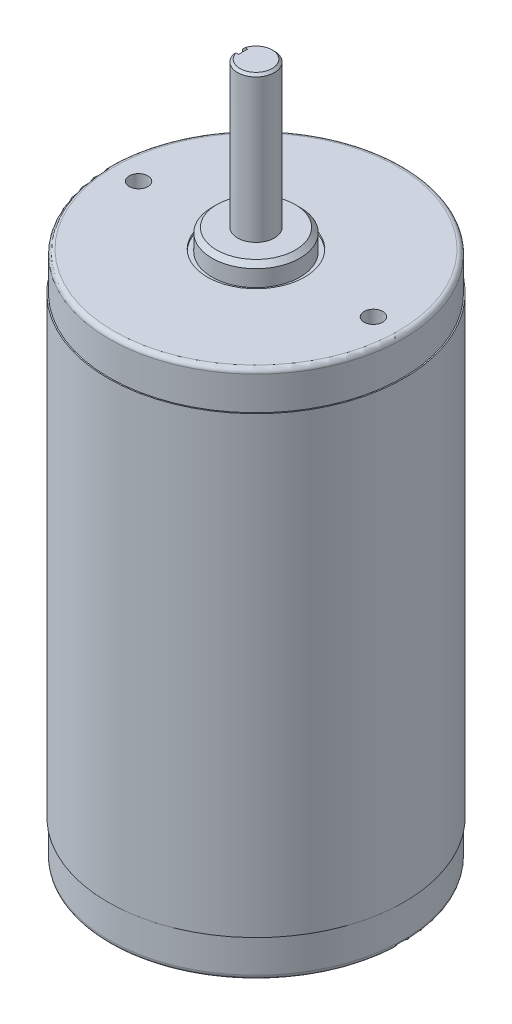
ISO-10303-21;
HEADER;
FILE_DESCRIPTION(('STEP AP214'),'2;1');
FILE_NAME('part.step','',(''),(''),'','','');
FILE_SCHEMA(('AUTOMOTIVE_DESIGN { 1 0 10303 214 1 1 1 1 }'));
ENDSEC;
DATA;
#1=APPLICATION_CONTEXT('core data for automotive mechanical design processes');
#2=APPLICATION_PROTOCOL_DEFINITION('international standard','automotive_design',2000,#1);
#3=PRODUCT_CONTEXT('',#1,'mechanical');
#4=PRODUCT('Part','Part','',(#3));
#5=PRODUCT_RELATED_PRODUCT_CATEGORY('part','',(#4));
#6=PRODUCT_DEFINITION_FORMATION('','',#4);
#7=PRODUCT_DEFINITION_CONTEXT('part definition',#1,'design');
#8=PRODUCT_DEFINITION('design','',#6,#7);
#9=PRODUCT_DEFINITION_SHAPE('','',#8);
#10=(LENGTH_UNIT() NAMED_UNIT(*) SI_UNIT(.MILLI.,.METRE.));
#11=(NAMED_UNIT(*) PLANE_ANGLE_UNIT() SI_UNIT($,.RADIAN.));
#12=(NAMED_UNIT(*) SI_UNIT($,.STERADIAN.) SOLID_ANGLE_UNIT());
#13=UNCERTAINTY_MEASURE_WITH_UNIT(LENGTH_MEASURE(1.E-05),#10,'distance_accuracy_value','');
#14=(GEOMETRIC_REPRESENTATION_CONTEXT(3) GLOBAL_UNCERTAINTY_ASSIGNED_CONTEXT((#13)) GLOBAL_UNIT_ASSIGNED_CONTEXT((#10,
#11,#12)) REPRESENTATION_CONTEXT('',''));
#15=CARTESIAN_POINT('',(0.,0.,0.));
#16=DIRECTION('',(0.,0.,1.));
#17=DIRECTION('',(1.,0.,0.));
#18=AXIS2_PLACEMENT_3D('',#15,#16,#17);
#19=CARTESIAN_POINT('',(15.0368,4.76250000000002,0.));
#20=DIRECTION('',(0.,-1.,0.));
#21=DIRECTION('',(0.,0.,-1.));
#22=AXIS2_PLACEMENT_3D('',#19,#20,#21);
#23=PLANE('',#22);
#24=CARTESIAN_POINT('',(-18.6070906828555,4.76250000000002,11.207359639096));
#25=DIRECTION('',(0.,-1.,0.));
#26=DIRECTION('',(0.,0.,-1.));
#27=AXIS2_PLACEMENT_3D('',#24,#25,#26);
#28=CIRCLE('',#27,4.318);
#29=CARTESIAN_POINT('',(-18.6070906828555,4.76250000000002,6.889359639096));
#30=VERTEX_POINT('',#29);
#31=EDGE_CURVE('E117',#30,#30,#28,.T.);
#32=ORIENTED_EDGE('',*,*,#31,.F.);
#33=EDGE_LOOP('',(#32));
#34=FACE_BOUND('',#33,.T.);
#35=CARTESIAN_POINT('',(0.,4.76250000000002,0.));
#36=DIRECTION('',(0.,-1.,0.));
#37=DIRECTION('',(0.,0.,-1.));
#38=AXIS2_PLACEMENT_3D('',#35,#36,#37);
#39=CIRCLE('',#38,30.7499999999996);
#40=CARTESIAN_POINT('',(0.,4.76250000000002,-30.7499999999996));
#41=VERTEX_POINT('',#40);
#42=EDGE_CURVE('E177',#41,#41,#39,.T.);
#43=ORIENTED_EDGE('',*,*,#42,.T.);
#44=EDGE_LOOP('',(#43));
#45=FACE_BOUND('',#44,.T.);
#46=CARTESIAN_POINT('',(0.,4.76250000000005,0.));
#47=DIRECTION('',(0.,-1.,0.));
#48=DIRECTION('',(0.,0.,-1.));
#49=AXIS2_PLACEMENT_3D('',#46,#47,#48);
#50=CIRCLE('',#49,15.0368);
#51=CARTESIAN_POINT('',(0.,4.76250000000005,-15.0368));
#52=VERTEX_POINT('',#51);
#53=EDGE_CURVE('E162',#52,#52,#50,.T.);
#54=ORIENTED_EDGE('',*,*,#53,.F.);
#55=EDGE_LOOP('',(#54));
#56=FACE_BOUND('',#55,.T.);
#57=CARTESIAN_POINT('',(-11.2073649648726,4.76250000000002,18.6070874750508));
#58=DIRECTION('',(0.,-1.,0.));
#59=DIRECTION('',(-0.467582362918068,0.,-0.883949508675668));
#60=AXIS2_PLACEMENT_3D('',#57,#58,#59);
#61=CIRCLE('',#60,4.318);
#62=CARTESIAN_POINT('',(-13.2263856079528,4.76250000000002,14.7901934965892));
#63=VERTEX_POINT('',#62);
#64=EDGE_CURVE('E335',#63,#63,#61,.T.);
#65=ORIENTED_EDGE('',*,*,#64,.F.);
#66=EDGE_LOOP('',(#65));
#67=FACE_BOUND('',#66,.T.);
#68=ADVANCED_FACE('F38',(#34,#45,#56,#67),#23,.T.);
#69=CARTESIAN_POINT('',(0.,0.,0.));
#70=DIRECTION('',(0.,-1.,0.));
#71=DIRECTION('',(0.,0.,-1.));
#72=AXIS2_PLACEMENT_3D('',#69,#70,#71);
#73=PLANE('',#72);
#74=CARTESIAN_POINT('',(0.,0.,0.));
#75=DIRECTION('',(0.,-1.,0.));
#76=DIRECTION('',(0.,0.,-1.));
#77=AXIS2_PLACEMENT_3D('',#74,#75,#76);
#78=CIRCLE('',#77,14.0368);
#79=CARTESIAN_POINT('',(0.,0.,-14.0368));
#80=VERTEX_POINT('',#79);
#81=EDGE_CURVE('E183',#80,#80,#78,.T.);
#82=ORIENTED_EDGE('',*,*,#81,.T.);
#83=EDGE_LOOP('',(#82));
#84=FACE_BOUND('',#83,.T.);
#85=ADVANCED_FACE('F296',(#84),#73,.T.);
#86=CARTESIAN_POINT('',(0.,0.,0.));
#87=DIRECTION('',(0.,-1.,0.));
#88=DIRECTION('',(0.,0.,-1.));
#89=AXIS2_PLACEMENT_3D('',#86,#87,#88);
#90=CYLINDRICAL_SURFACE('',#89,15.0368);
#91=CARTESIAN_POINT('',(0.,1.,0.));
#92=DIRECTION('',(0.,-1.,0.));
#93=DIRECTION('',(0.,0.,-1.));
#94=AXIS2_PLACEMENT_3D('',#91,#92,#93);
#95=CIRCLE('',#94,15.0368);
#96=CARTESIAN_POINT('',(0.,1.,-15.0368));
#97=VERTEX_POINT('',#96);
#98=EDGE_CURVE('E100',#97,#97,#95,.F.);
#99=ORIENTED_EDGE('',*,*,#98,.T.);
#100=EDGE_LOOP('',(#99));
#101=FACE_BOUND('',#100,.T.);
#102=ORIENTED_EDGE('',*,*,#53,.T.);
#103=EDGE_LOOP('',(#102));
#104=FACE_BOUND('',#103,.T.);
#105=ADVANCED_FACE('F292',(#101,#104),#90,.T.);
#106=CARTESIAN_POINT('',(0.,0.,0.));
#107=DIRECTION('',(0.,-1.,0.));
#108=DIRECTION('',(0.,0.,-1.));
#109=AXIS2_PLACEMENT_3D('',#106,#107,#108);
#110=CYLINDRICAL_SURFACE('',#109,31.7499999999996);
#111=CARTESIAN_POINT('',(0.,5.76250000000002,0.));
#112=DIRECTION('',(0.,-1.,0.));
#113=DIRECTION('',(0.,0.,-1.));
#114=AXIS2_PLACEMENT_3D('',#111,#112,#113);
#115=CIRCLE('',#114,31.7499999999996);
#116=CARTESIAN_POINT('',(0.,5.76250000000002,-31.7499999999996));
#117=VERTEX_POINT('',#116);
#118=EDGE_CURVE('E180',#117,#117,#115,.F.);
#119=ORIENTED_EDGE('',*,*,#118,.T.);
#120=EDGE_LOOP('',(#119));
#121=FACE_BOUND('',#120,.T.);
#122=CARTESIAN_POINT('',(0.,12.9921000000001,0.));
#123=DIRECTION('',(0.,-1.,0.));
#124=DIRECTION('',(0.,0.,-1.));
#125=AXIS2_PLACEMENT_3D('',#122,#123,#124);
#126=CIRCLE('',#125,31.7499999999996);
#127=CARTESIAN_POINT('',(0.,12.9921000000001,-31.7499999999996));
#128=VERTEX_POINT('',#127);
#129=EDGE_CURVE('E159',#128,#128,#126,.T.);
#130=ORIENTED_EDGE('',*,*,#129,.T.);
#131=EDGE_LOOP('',(#130));
#132=FACE_BOUND('',#131,.T.);
#133=ADVANCED_FACE('F288',(#121,#132),#110,.T.);
#134=CARTESIAN_POINT('',(31.7499999999996,12.9921000000001,0.));
#135=DIRECTION('',(0.,-1.,0.));
#136=DIRECTION('',(0.,0.,-1.));
#137=AXIS2_PLACEMENT_3D('',#134,#135,#136);
#138=PLANE('',#137);
#139=CARTESIAN_POINT('',(0.,12.9921000000001,0.));
#140=DIRECTION('',(0.,-1.,0.));
#141=DIRECTION('',(0.,0.,-1.));
#142=AXIS2_PLACEMENT_3D('',#139,#140,#141);
#143=CIRCLE('',#142,32.004);
#144=CARTESIAN_POINT('',(0.,12.9921000000001,-32.004));
#145=VERTEX_POINT('',#144);
#146=EDGE_CURVE('E156',#145,#145,#143,.T.);
#147=ORIENTED_EDGE('',*,*,#146,.T.);
#148=EDGE_LOOP('',(#147));
#149=FACE_BOUND('',#148,.T.);
#150=ORIENTED_EDGE('',*,*,#129,.F.);
#151=EDGE_LOOP('',(#150));
#152=FACE_BOUND('',#151,.T.);
#153=ADVANCED_FACE('F284',(#149,#152),#138,.T.);
#154=CARTESIAN_POINT('',(0.,0.,0.));
#155=DIRECTION('',(0.,-1.,0.));
#156=DIRECTION('',(0.,0.,-1.));
#157=AXIS2_PLACEMENT_3D('',#154,#155,#156);
#158=CYLINDRICAL_SURFACE('',#157,32.0039999999998);
#159=CARTESIAN_POINT('',(0.,111.1377,0.));
#160=DIRECTION('',(0.,-1.,0.));
#161=DIRECTION('',(0.,0.,-1.));
#162=AXIS2_PLACEMENT_3D('',#159,#160,#161);
#163=CIRCLE('',#162,32.0039999999996);
#164=CARTESIAN_POINT('',(0.,111.1377,-32.0039999999996));
#165=VERTEX_POINT('',#164);
#166=EDGE_CURVE('E153',#165,#165,#163,.T.);
#167=ORIENTED_EDGE('',*,*,#166,.T.);
#168=EDGE_LOOP('',(#167));
#169=FACE_BOUND('',#168,.T.);
#170=ORIENTED_EDGE('',*,*,#146,.F.);
#171=EDGE_LOOP('',(#170));
#172=FACE_BOUND('',#171,.T.);
#173=ADVANCED_FACE('F280',(#169,#172),#158,.T.);
#174=CARTESIAN_POINT('',(32.0039999999996,111.1377,0.));
#175=DIRECTION('',(0.,1.,0.));
#176=DIRECTION('',(0.,0.,1.));
#177=AXIS2_PLACEMENT_3D('',#174,#175,#176);
#178=PLANE('',#177);
#179=CARTESIAN_POINT('',(0.,111.1377,0.));
#180=DIRECTION('',(0.,-1.,0.));
#181=DIRECTION('',(0.,0.,-1.));
#182=AXIS2_PLACEMENT_3D('',#179,#180,#181);
#183=CIRCLE('',#182,31.7499999999996);
#184=CARTESIAN_POINT('',(0.,111.1377,-31.7499999999996));
#185=VERTEX_POINT('',#184);
#186=EDGE_CURVE('E150',#185,#185,#183,.T.);
#187=ORIENTED_EDGE('',*,*,#186,.T.);
#188=EDGE_LOOP('',(#187));
#189=FACE_BOUND('',#188,.T.);
#190=ORIENTED_EDGE('',*,*,#166,.F.);
#191=EDGE_LOOP('',(#190));
#192=FACE_BOUND('',#191,.T.);
#193=ADVANCED_FACE('F276',(#189,#192),#178,.T.);
#194=CARTESIAN_POINT('',(0.,0.,0.));
#195=DIRECTION('',(0.,-1.,0.));
#196=DIRECTION('',(0.,0.,-1.));
#197=AXIS2_PLACEMENT_3D('',#194,#195,#196);
#198=CYLINDRICAL_SURFACE('',#197,31.7499999999996);
#199=CARTESIAN_POINT('',(0.,118.3673,0.));
#200=DIRECTION('',(0.,1.,0.));
#201=DIRECTION('',(0.,0.,1.));
#202=AXIS2_PLACEMENT_3D('',#199,#200,#201);
#203=CIRCLE('',#202,31.7499999999996);
#204=CARTESIAN_POINT('',(0.,118.3673,31.7499999999996));
#205=VERTEX_POINT('',#204);
#206=EDGE_CURVE('E171',#205,#205,#203,.F.);
#207=ORIENTED_EDGE('',*,*,#206,.T.);
#208=EDGE_LOOP('',(#207));
#209=FACE_BOUND('',#208,.T.);
#210=ORIENTED_EDGE('',*,*,#186,.F.);
#211=EDGE_LOOP('',(#210));
#212=FACE_BOUND('',#211,.T.);
#213=ADVANCED_FACE('F272',(#209,#212),#198,.T.);
#214=CARTESIAN_POINT('',(31.7499999999996,119.3673,0.));
#215=DIRECTION('',(0.,1.,0.));
#216=DIRECTION('',(0.,0.,1.));
#217=AXIS2_PLACEMENT_3D('',#214,#215,#216);
#218=PLANE('',#217);
#219=CARTESIAN_POINT('',(-25.4,119.3673,0.));
#220=DIRECTION('',(0.,1.,0.));
#221=DIRECTION('',(0.,0.,1.));
#222=AXIS2_PLACEMENT_3D('',#219,#220,#221);
#223=CIRCLE('',#222,2.0193);
#224=CARTESIAN_POINT('',(-25.4,119.3673,2.0193));
#225=VERTEX_POINT('',#224);
#226=EDGE_CURVE('E126',#225,#225,#223,.T.);
#227=ORIENTED_EDGE('',*,*,#226,.F.);
#228=EDGE_LOOP('',(#227));
#229=FACE_BOUND('',#228,.T.);
#230=CARTESIAN_POINT('',(25.4,119.3673,0.));
#231=DIRECTION('',(0.,1.,0.));
#232=DIRECTION('',(0.,0.,1.));
#233=AXIS2_PLACEMENT_3D('',#230,#231,#232);
#234=CIRCLE('',#233,2.0193);
#235=CARTESIAN_POINT('',(25.4,119.3673,2.01929999999999));
#236=VERTEX_POINT('',#235);
#237=EDGE_CURVE('E132',#236,#236,#234,.T.);
#238=ORIENTED_EDGE('',*,*,#237,.F.);
#239=EDGE_LOOP('',(#238));
#240=FACE_BOUND('',#239,.T.);
#241=CARTESIAN_POINT('',(0.,119.3673,0.));
#242=DIRECTION('',(0.,1.,0.));
#243=DIRECTION('',(0.,0.,1.));
#244=AXIS2_PLACEMENT_3D('',#241,#242,#243);
#245=CIRCLE('',#244,30.7499999999996);
#246=CARTESIAN_POINT('',(0.,119.3673,30.7499999999996));
#247=VERTEX_POINT('',#246);
#248=EDGE_CURVE('E174',#247,#247,#245,.T.);
#249=ORIENTED_EDGE('',*,*,#248,.T.);
#250=EDGE_LOOP('',(#249));
#251=FACE_BOUND('',#250,.T.);
#252=CARTESIAN_POINT('',(0.,119.3673,0.));
#253=DIRECTION('',(0.,-1.,0.));
#254=DIRECTION('',(0.,0.,-1.));
#255=AXIS2_PLACEMENT_3D('',#252,#253,#254);
#256=CIRCLE('',#255,10.5282999999996);
#257=CARTESIAN_POINT('',(0.,119.3673,-10.5282999999996));
#258=VERTEX_POINT('',#257);
#259=EDGE_CURVE('E147',#258,#258,#256,.T.);
#260=ORIENTED_EDGE('',*,*,#259,.T.);
#261=EDGE_LOOP('',(#260));
#262=FACE_BOUND('',#261,.T.);
#263=ADVANCED_FACE('F268',(#229,#240,#251,#262),#218,.T.);
#264=CARTESIAN_POINT('',(0.,0.,0.));
#265=DIRECTION('',(0.,-1.,0.));
#266=DIRECTION('',(0.,0.,-1.));
#267=AXIS2_PLACEMENT_3D('',#264,#265,#266);
#268=CYLINDRICAL_SURFACE('',#267,10.5282999999996);
#269=CARTESIAN_POINT('',(0.,118.8593,0.));
#270=DIRECTION('',(0.,-1.,0.));
#271=DIRECTION('',(0.,0.,-1.));
#272=AXIS2_PLACEMENT_3D('',#269,#270,#271);
#273=CIRCLE('',#272,10.5282999999996);
#274=CARTESIAN_POINT('',(0.,118.8593,-10.5282999999996));
#275=VERTEX_POINT('',#274);
#276=EDGE_CURVE('E144',#275,#275,#273,.T.);
#277=ORIENTED_EDGE('',*,*,#276,.T.);
#278=EDGE_LOOP('',(#277));
#279=FACE_BOUND('',#278,.T.);
#280=ORIENTED_EDGE('',*,*,#259,.F.);
#281=EDGE_LOOP('',(#280));
#282=FACE_BOUND('',#281,.T.);
#283=ADVANCED_FACE('F264',(#279,#282),#268,.F.);
#284=CARTESIAN_POINT('',(10.5282999999996,118.8593,0.));
#285=DIRECTION('',(0.,1.,0.));
#286=DIRECTION('',(0.,0.,1.));
#287=AXIS2_PLACEMENT_3D('',#284,#285,#286);
#288=PLANE('',#287);
#289=CARTESIAN_POINT('',(0.,118.8593,0.));
#290=DIRECTION('',(0.,-1.,0.));
#291=DIRECTION('',(0.,0.,-1.));
#292=AXIS2_PLACEMENT_3D('',#289,#290,#291);
#293=CIRCLE('',#292,9.52499999999959);
#294=CARTESIAN_POINT('',(0.,118.8593,-9.52499999999959));
#295=VERTEX_POINT('',#294);
#296=EDGE_CURVE('E141',#295,#295,#293,.T.);
#297=ORIENTED_EDGE('',*,*,#296,.T.);
#298=EDGE_LOOP('',(#297));
#299=FACE_BOUND('',#298,.T.);
#300=ORIENTED_EDGE('',*,*,#276,.F.);
#301=EDGE_LOOP('',(#300));
#302=FACE_BOUND('',#301,.T.);
#303=ADVANCED_FACE('F260',(#299,#302),#288,.T.);
#304=CARTESIAN_POINT('',(0.,0.,0.));
#305=DIRECTION('',(0.,-1.,0.));
#306=DIRECTION('',(0.,0.,-1.));
#307=AXIS2_PLACEMENT_3D('',#304,#305,#306);
#308=CYLINDRICAL_SURFACE('',#307,9.52499999999959);
#309=CARTESIAN_POINT('',(0.,122.41508364,0.));
#310=DIRECTION('',(0.,1.,0.));
#311=DIRECTION('',(0.,0.,1.));
#312=AXIS2_PLACEMENT_3D('',#309,#310,#311);
#313=CIRCLE('',#312,9.52499999999959);
#314=CARTESIAN_POINT('',(0.,122.41508364,9.52499999999959));
#315=VERTEX_POINT('',#314);
#316=EDGE_CURVE('E165',#315,#315,#313,.F.);
#317=ORIENTED_EDGE('',*,*,#316,.T.);
#318=EDGE_LOOP('',(#317));
#319=FACE_BOUND('',#318,.T.);
#320=ORIENTED_EDGE('',*,*,#296,.F.);
#321=EDGE_LOOP('',(#320));
#322=FACE_BOUND('',#321,.T.);
#323=ADVANCED_FACE('F256',(#319,#322),#308,.T.);
#324=CARTESIAN_POINT('',(9.52499999999959,123.4313,0.));
#325=DIRECTION('',(0.,1.,0.));
#326=DIRECTION('',(0.,0.,1.));
#327=AXIS2_PLACEMENT_3D('',#324,#325,#326);
#328=PLANE('',#327);
#329=CARTESIAN_POINT('',(0.,123.4313,0.));
#330=DIRECTION('',(0.,1.,0.));
#331=DIRECTION('',(0.,0.,1.));
#332=AXIS2_PLACEMENT_3D('',#329,#330,#331);
#333=CIRCLE('',#332,8.50878363999956);
#334=CARTESIAN_POINT('',(0.,123.4313,8.50878363999956));
#335=VERTEX_POINT('',#334);
#336=EDGE_CURVE('E168',#335,#335,#333,.T.);
#337=ORIENTED_EDGE('',*,*,#336,.T.);
#338=EDGE_LOOP('',(#337));
#339=FACE_BOUND('',#338,.T.);
#340=CARTESIAN_POINT('',(0.,123.4313,0.));
#341=DIRECTION('',(0.,-1.,0.));
#342=DIRECTION('',(0.,0.,-1.));
#343=AXIS2_PLACEMENT_3D('',#340,#341,#342);
#344=CIRCLE('',#343,4.00000469999957);
#345=CARTESIAN_POINT('',(0.,123.4313,-4.00000469999957));
#346=VERTEX_POINT('',#345);
#347=EDGE_CURVE('E138',#346,#346,#344,.T.);
#348=ORIENTED_EDGE('',*,*,#347,.T.);
#349=EDGE_LOOP('',(#348));
#350=FACE_BOUND('',#349,.T.);
#351=ADVANCED_FACE('F251',(#339,#350),#328,.T.);
#352=CARTESIAN_POINT('',(0.,0.,0.));
#353=DIRECTION('',(0.,-1.,0.));
#354=DIRECTION('',(0.,0.,-1.));
#355=AXIS2_PLACEMENT_3D('',#352,#353,#354);
#356=CYLINDRICAL_SURFACE('',#355,4.00000469999952);
#357=DIRECTION('',(0.,-1.,0.));
#358=VECTOR('',#357,1.);
#359=CARTESIAN_POINT('',(-3.87298871674244,0.,-0.999998));
#360=LINE('',#359,#358);
#361=CARTESIAN_POINT('',(-3.87298871674244,154.423364,-0.999998));
#362=VERTEX_POINT('',#361);
#363=CARTESIAN_POINT('',(-3.87298871674244,125.131364,-0.999998));
#364=VERTEX_POINT('',#363);
#365=EDGE_CURVE('E124',#362,#364,#360,.T.);
#366=ORIENTED_EDGE('',*,*,#365,.F.);
#367=CARTESIAN_POINT('',(0.,154.423364,0.));
#368=DIRECTION('',(0.,1.,0.));
#369=DIRECTION('',(0.,0.,1.));
#370=AXIS2_PLACEMENT_3D('',#367,#368,#369);
#371=CIRCLE('',#370,4.00000469999952);
#372=CARTESIAN_POINT('',(-3.87298871674244,154.423364,0.999998));
#373=VERTEX_POINT('',#372);
#374=EDGE_CURVE('E234',#362,#373,#371,.F.);
#375=ORIENTED_EDGE('',*,*,#374,.T.);
#376=DIRECTION('',(0.,-1.,0.));
#377=VECTOR('',#376,1.);
#378=CARTESIAN_POINT('',(-3.87298871674244,0.,0.999998));
#379=LINE('',#378,#377);
#380=CARTESIAN_POINT('',(-3.87298871674244,125.131364,0.999998));
#381=VERTEX_POINT('',#380);
#382=EDGE_CURVE('E121',#381,#373,#379,.F.);
#383=ORIENTED_EDGE('',*,*,#382,.F.);
#384=CARTESIAN_POINT('',(0.,125.131364,0.));
#385=DIRECTION('',(0.,-1.,0.));
#386=DIRECTION('',(0.,0.,-1.));
#387=AXIS2_PLACEMENT_3D('',#384,#385,#386);
#388=CIRCLE('',#387,4.00000469999952);
#389=EDGE_CURVE('E99',#364,#381,#388,.F.);
#390=ORIENTED_EDGE('',*,*,#389,.F.);
#391=EDGE_LOOP('',(#366,#375,#383,#390));
#392=FACE_BOUND('',#391,.T.);
#393=ORIENTED_EDGE('',*,*,#347,.F.);
#394=EDGE_LOOP('',(#393));
#395=FACE_BOUND('',#394,.T.);
#396=ADVANCED_FACE('F246',(#392,#395),#356,.T.);
#397=CARTESIAN_POINT('',(4.00000469999946,154.931364,0.));
#398=DIRECTION('',(0.,1.,0.));
#399=DIRECTION('',(0.,0.,1.));
#400=AXIS2_PLACEMENT_3D('',#397,#398,#399);
#401=PLANE('',#400);
#402=DIRECTION('',(1.,0.,0.));
#403=VECTOR('',#402,1.);
#404=CARTESIAN_POINT('',(4.00000469999946,154.931364,0.999998));
#405=LINE('',#404,#403);
#406=CARTESIAN_POINT('',(-3.34575863218109,154.931364,0.999998));
#407=VERTEX_POINT('',#406);
#408=CARTESIAN_POINT('',(-2.79985469999946,154.931364,0.999998));
#409=VERTEX_POINT('',#408);
#410=EDGE_CURVE('E93',#407,#409,#405,.T.);
#411=ORIENTED_EDGE('',*,*,#410,.F.);
#412=CARTESIAN_POINT('',(0.,154.931364,0.));
#413=DIRECTION('',(0.,1.,0.));
#414=DIRECTION('',(0.,0.,1.));
#415=AXIS2_PLACEMENT_3D('',#412,#413,#414);
#416=CIRCLE('',#415,3.49200469999945);
#417=CARTESIAN_POINT('',(-3.34575863218109,154.931364,-0.999998));
#418=VERTEX_POINT('',#417);
#419=EDGE_CURVE('E51',#407,#418,#416,.T.);
#420=ORIENTED_EDGE('',*,*,#419,.T.);
#421=DIRECTION('',(-1.,0.,0.));
#422=VECTOR('',#421,1.);
#423=CARTESIAN_POINT('',(-4.00000469999946,154.931364,-0.999998));
#424=LINE('',#423,#422);
#425=CARTESIAN_POINT('',(-2.79985469999946,154.931364,-0.999998));
#426=VERTEX_POINT('',#425);
#427=EDGE_CURVE('E110',#426,#418,#424,.T.);
#428=ORIENTED_EDGE('',*,*,#427,.F.);
#429=DIRECTION('',(0.,0.,-1.));
#430=VECTOR('',#429,1.);
#431=CARTESIAN_POINT('',(-2.79985469999946,154.931364,0.999998));
#432=LINE('',#431,#430);
#433=EDGE_CURVE('E106',#409,#426,#432,.T.);
#434=ORIENTED_EDGE('',*,*,#433,.F.);
#435=EDGE_LOOP('',(#411,#420,#428,#434));
#436=FACE_BOUND('',#435,.T.);
#437=ADVANCED_FACE('F112',(#436),#401,.T.);
#438=CARTESIAN_POINT('',(0.,122.41508364,0.));
#439=DIRECTION('',(0.,-1.,0.));
#440=DIRECTION('',(0.,0.,-1.));
#441=AXIS2_PLACEMENT_3D('',#438,#439,#440);
#442=CONICAL_SURFACE('',#441,9.52499999999959,0.785398163397455);
#443=ORIENTED_EDGE('',*,*,#336,.F.);
#444=EDGE_LOOP('',(#443));
#445=FACE_BOUND('',#444,.T.);
#446=ORIENTED_EDGE('',*,*,#316,.F.);
#447=EDGE_LOOP('',(#446));
#448=FACE_BOUND('',#447,.T.);
#449=ADVANCED_FACE('F304',(#445,#448),#442,.T.);
#450=CARTESIAN_POINT('',(0.,118.3673,0.));
#451=DIRECTION('',(0.,1.,0.));
#452=DIRECTION('',(0.,0.,1.));
#453=AXIS2_PLACEMENT_3D('',#450,#451,#452);
#454=TOROIDAL_SURFACE('',#453,30.7499999999996,1.);
#455=ORIENTED_EDGE('',*,*,#248,.F.);
#456=EDGE_LOOP('',(#455));
#457=FACE_BOUND('',#456,.T.);
#458=ORIENTED_EDGE('',*,*,#206,.F.);
#459=EDGE_LOOP('',(#458));
#460=FACE_BOUND('',#459,.T.);
#461=ADVANCED_FACE('F307',(#457,#460),#454,.T.);
#462=CARTESIAN_POINT('',(0.,5.76250000000002,0.));
#463=DIRECTION('',(0.,-1.,0.));
#464=DIRECTION('',(0.,0.,-1.));
#465=AXIS2_PLACEMENT_3D('',#462,#463,#464);
#466=TOROIDAL_SURFACE('',#465,30.7499999999996,1.);
#467=ORIENTED_EDGE('',*,*,#118,.F.);
#468=EDGE_LOOP('',(#467));
#469=FACE_BOUND('',#468,.T.);
#470=ORIENTED_EDGE('',*,*,#42,.F.);
#471=EDGE_LOOP('',(#470));
#472=FACE_BOUND('',#471,.T.);
#473=ADVANCED_FACE('F311',(#469,#472),#466,.T.);
#474=CARTESIAN_POINT('',(0.,1.,0.));
#475=DIRECTION('',(0.,-1.,0.));
#476=DIRECTION('',(0.,0.,-1.));
#477=AXIS2_PLACEMENT_3D('',#474,#475,#476);
#478=TOROIDAL_SURFACE('',#477,14.0368,1.);
#479=ORIENTED_EDGE('',*,*,#98,.F.);
#480=EDGE_LOOP('',(#479));
#481=FACE_BOUND('',#480,.T.);
#482=ORIENTED_EDGE('',*,*,#81,.F.);
#483=EDGE_LOOP('',(#482));
#484=FACE_BOUND('',#483,.T.);
#485=ADVANCED_FACE('F315',(#481,#484),#478,.T.);
#486=CARTESIAN_POINT('',(25.4,105.7529,0.));
#487=DIRECTION('',(0.,1.,0.));
#488=DIRECTION('',(0.,0.,1.));
#489=AXIS2_PLACEMENT_3D('',#486,#487,#488);
#490=CONICAL_SURFACE('',#489,2.0193,1.02974425867665);
#491=CARTESIAN_POINT('',(25.4,104.539582151998,0.));
#492=VERTEX_POINT('',#491);
#493=VERTEX_LOOP('',#492);
#494=FACE_BOUND('',#493,.T.);
#495=CARTESIAN_POINT('',(25.4,105.7529,0.));
#496=DIRECTION('',(0.,1.,0.));
#497=DIRECTION('',(0.,0.,1.));
#498=AXIS2_PLACEMENT_3D('',#495,#496,#497);
#499=CIRCLE('',#498,2.0193);
#500=CARTESIAN_POINT('',(25.4,105.7529,2.01929999999999));
#501=VERTEX_POINT('',#500);
#502=EDGE_CURVE('E135',#501,#501,#499,.T.);
#503=ORIENTED_EDGE('',*,*,#502,.T.);
#504=EDGE_LOOP('',(#503));
#505=FACE_BOUND('',#504,.T.);
#506=ADVANCED_FACE('F318',(#494,#505),#490,.F.);
#507=CARTESIAN_POINT('',(25.4,119.3673,0.));
#508=DIRECTION('',(0.,1.,0.));
#509=DIRECTION('',(0.,0.,1.));
#510=AXIS2_PLACEMENT_3D('',#507,#508,#509);
#511=CYLINDRICAL_SURFACE('',#510,2.0193);
#512=ORIENTED_EDGE('',*,*,#502,.F.);
#513=EDGE_LOOP('',(#512));
#514=FACE_BOUND('',#513,.T.);
#515=ORIENTED_EDGE('',*,*,#237,.T.);
#516=EDGE_LOOP('',(#515));
#517=FACE_BOUND('',#516,.T.);
#518=ADVANCED_FACE('F324',(#514,#517),#511,.F.);
#519=CARTESIAN_POINT('',(-25.4,105.7529,0.));
#520=DIRECTION('',(0.,1.,0.));
#521=DIRECTION('',(0.,0.,1.));
#522=AXIS2_PLACEMENT_3D('',#519,#520,#521);
#523=CONICAL_SURFACE('',#522,2.0193,1.02974425867665);
#524=CARTESIAN_POINT('',(-25.4,104.539582151998,0.));
#525=VERTEX_POINT('',#524);
#526=VERTEX_LOOP('',#525);
#527=FACE_BOUND('',#526,.T.);
#528=CARTESIAN_POINT('',(-25.4,105.7529,0.));
#529=DIRECTION('',(0.,1.,0.));
#530=DIRECTION('',(0.,0.,1.));
#531=AXIS2_PLACEMENT_3D('',#528,#529,#530);
#532=CIRCLE('',#531,2.0193);
#533=CARTESIAN_POINT('',(-25.4,105.7529,2.0193));
#534=VERTEX_POINT('',#533);
#535=EDGE_CURVE('E129',#534,#534,#532,.T.);
#536=ORIENTED_EDGE('',*,*,#535,.T.);
#537=EDGE_LOOP('',(#536));
#538=FACE_BOUND('',#537,.T.);
#539=ADVANCED_FACE('F483',(#527,#538),#523,.F.);
#540=CARTESIAN_POINT('',(-25.4,119.3673,0.));
#541=DIRECTION('',(0.,1.,0.));
#542=DIRECTION('',(0.,0.,1.));
#543=AXIS2_PLACEMENT_3D('',#540,#541,#542);
#544=CYLINDRICAL_SURFACE('',#543,2.0193);
#545=ORIENTED_EDGE('',*,*,#535,.F.);
#546=EDGE_LOOP('',(#545));
#547=FACE_BOUND('',#546,.T.);
#548=ORIENTED_EDGE('',*,*,#226,.T.);
#549=EDGE_LOOP('',(#548));
#550=FACE_BOUND('',#549,.T.);
#551=ADVANCED_FACE('F210',(#547,#550),#544,.F.);
#552=CARTESIAN_POINT('',(-4.00000469999946,125.131364,-0.999998));
#553=DIRECTION('',(0.,0.,-1.));
#554=DIRECTION('',(-1.,0.,0.));
#555=AXIS2_PLACEMENT_3D('',#552,#553,#554);
#556=PLANE('',#555);
#557=ORIENTED_EDGE('',*,*,#427,.T.);
#558=CARTESIAN_POINT('',(-3.34575863218109,154.931364,-0.999998));
#559=CARTESIAN_POINT('',(-3.43385160215899,154.846926978976,-0.999998));
#560=CARTESIAN_POINT('',(-3.52183393260334,154.762375130216,-0.999998));
#561=CARTESIAN_POINT('',(-3.69757729407254,154.593041796829,-0.999998));
#562=CARTESIAN_POINT('',(-3.78533832514863,154.508260312257,-0.999998));
#563=CARTESIAN_POINT('',(-3.87298871674244,154.423364,-0.999998));
#564=B_SPLINE_CURVE_WITH_KNOTS('',3,(#558,#559,#560,#561,#562,#563),.UNSPECIFIED.,.F.,.F.,(4,2,
4),(0.,0.366072602626518,0.73214512046506),.UNSPECIFIED.);
#565=EDGE_CURVE('E11',#418,#362,#564,.T.);
#566=ORIENTED_EDGE('',*,*,#565,.T.);
#567=ORIENTED_EDGE('',*,*,#365,.T.);
#568=CARTESIAN_POINT('',(-3.79905669443276,125.131364,1.25188091786075));
#569=CARTESIAN_POINT('',(-2.79985469999946,126.610521480319,3.10078421492022));
#570=CARTESIAN_POINT('',(-2.79985469999946,128.215993174737,5.10757656032127));
#571=CARTESIAN_POINT('',(-3.81215439703632,125.131364,1.21215478678005));
#572=CARTESIAN_POINT('',(-2.79985469999946,126.717603162406,2.99272860297843));
#573=CARTESIAN_POINT('',(-2.79985469999946,128.440997221199,4.92770494646071));
#574=CARTESIAN_POINT('',(-3.82607602601714,125.131364,1.16779524297839));
#575=CARTESIAN_POINT('',(-2.79985469999946,126.817214454074,2.87383132031633));
#576=CARTESIAN_POINT('',(-2.79985469999946,128.651075098356,4.73003305864789));
#577=CARTESIAN_POINT('',(-3.854285281745,125.131364,1.07099923687937));
#578=CARTESIAN_POINT('',(-2.79985469999946,127.000530173814,2.61848732446307));
#579=CARTESIAN_POINT('',(-2.79985469999946,129.038769017272,4.30625756965911));
#580=CARTESIAN_POINT('',(-3.86857145888317,125.131364,1.01859155239082));
#581=CARTESIAN_POINT('',(-2.79985469999946,127.084281808879,2.48209057753652));
#582=CARTESIAN_POINT('',(-2.79985469999946,129.216495973371,4.08025577721848));
#583=CARTESIAN_POINT('',(-3.89801342639202,125.131364,0.899833914438038));
#584=CARTESIAN_POINT('',(-2.79985469999946,127.244719077503,2.17779945463202));
#585=CARTESIAN_POINT('',(-2.79985469999946,129.557922261875,3.57698050909868));
#586=CARTESIAN_POINT('',(-3.91306585264883,125.131364,0.832564530970009));
#587=CARTESIAN_POINT('',(-2.79985469999946,127.319307805925,2.00809777209683));
#588=CARTESIAN_POINT('',(-2.79985469999946,129.717334867958,3.29681130005391));
#589=CARTESIAN_POINT('',(-3.94058062131458,125.131364,0.690717280514064));
#590=CARTESIAN_POINT('',(-2.79985469999946,127.448141160549,1.65555417022524));
#591=CARTESIAN_POINT('',(-2.79985469999946,129.99342305222,2.71584710466487));
#592=CARTESIAN_POINT('',(-3.95303907233913,125.131364,0.616128676625266));
#593=CARTESIAN_POINT('',(-2.79985469999946,127.502336718355,1.47270481731396));
#594=CARTESIAN_POINT('',(-2.79985469999946,130.110034618953,2.41502201736828));
#595=CARTESIAN_POINT('',(-3.97543275952185,125.131364,0.451385773374705));
#596=CARTESIAN_POINT('',(-2.79985469999946,127.596441277175,1.07328329743611));
#597=CARTESIAN_POINT('',(-2.79985469999946,130.312887644152,1.75886937420155));
#598=CARTESIAN_POINT('',(-3.98480717107226,125.131364,0.360484238410521));
#599=CARTESIAN_POINT('',(-2.79985469999946,127.633442881905,0.855522533065359));
#600=CARTESIAN_POINT('',(-2.79985469999946,130.392976039456,1.40163569825842));
#601=CARTESIAN_POINT('',(-3.99724032536405,125.131364,0.175303193271348));
#602=CARTESIAN_POINT('',(-2.79985469999946,127.681949523323,0.414716779359214));
#603=CARTESIAN_POINT('',(-2.79985469999946,130.498020650855,0.679190638961237));
#604=CARTESIAN_POINT('',(-4.00029693419917,125.131364,0.0810225527018574));
#605=CARTESIAN_POINT('',(-2.79985469999946,127.693433055952,0.191726261516055));
#606=CARTESIAN_POINT('',(-2.79985469999946,130.522958239367,0.313976602230934));
#607=CARTESIAN_POINT('',(-3.99963811298894,125.131364,-0.116662006867769));
#608=CARTESIAN_POINT('',(-2.79985469999946,127.690941988436,-0.276054100195673));
#609=CARTESIAN_POINT('',(-2.79985469999946,130.517551937729,-0.452080334926588));
#610=CARTESIAN_POINT('',(-3.99522797189927,125.131364,-0.220052379026115));
#611=CARTESIAN_POINT('',(-2.79985469999946,127.674356881745,-0.520755373475166));
#612=CARTESIAN_POINT('',(-2.79985469999946,130.481537121496,-0.852899059660325));
#613=CARTESIAN_POINT('',(-3.97897451054945,125.131364,-0.422010861386271));
#614=CARTESIAN_POINT('',(-2.79985469999946,127.610276786703,-1.00275226484209));
#615=CARTESIAN_POINT('',(-2.79985469999946,130.342860930299,-1.64312157316645));
#616=CARTESIAN_POINT('',(-3.96712637105358,125.131364,-0.520575800420573));
#617=CARTESIAN_POINT('',(-2.79985469999946,127.56278196205,-1.23997160558483));
#618=CARTESIAN_POINT('',(-2.79985469999946,130.240156344147,-2.03251778970508));
#619=CARTESIAN_POINT('',(-3.93790304235114,125.131364,-0.708513448543741));
#620=CARTESIAN_POINT('',(-2.79985469999946,127.436075986486,-1.69903294420047));
#621=CARTESIAN_POINT('',(-2.79985469999946,129.967513734673,-2.78737691914001));
#622=CARTESIAN_POINT('',(-3.92053146978515,125.131364,-0.797892122095242));
#623=CARTESIAN_POINT('',(-2.79985469999947,127.356919105973,-1.92084177708723));
#624=CARTESIAN_POINT('',(-2.79985469999946,129.797619688053,-3.15285530469029));
#625=CARTESIAN_POINT('',(-3.8925084810203,125.131364,-0.92208328673317));
#626=CARTESIAN_POINT('',(-2.79985469999946,127.214464597677,-2.23484305545127));
#627=CARTESIAN_POINT('',(-2.79985469999946,129.493594295214,-3.67127939847112));
#628=CARTESIAN_POINT('',(-3.88284611793795,125.131364,-0.961813801055341));
#629=CARTESIAN_POINT('',(-2.79985469999946,127.163083705247,-2.3363065813234));
#630=CARTESIAN_POINT('',(-2.79985469999946,129.384133649716,-3.83903223434498));
#631=CARTESIAN_POINT('',(-3.86326550067513,125.131364,-1.03766243098715));
#632=CARTESIAN_POINT('',(-2.79985469999946,127.052502981653,-2.53191426862443));
#633=CARTESIAN_POINT('',(-2.79985469999946,129.149130196933,-4.1628124553753));
#634=CARTESIAN_POINT('',(-3.85334742863699,125.131364,-1.07378303314694));
#635=CARTESIAN_POINT('',(-2.79985469999946,126.993312352991,-2.62606531373243));
#636=CARTESIAN_POINT('',(-2.79985469999946,129.023598597369,-4.31884789293767));
#637=CARTESIAN_POINT('',(-3.8347922099221,125.131364,-1.13815616448415));
#638=CARTESIAN_POINT('',(-2.79985469999946,126.874526399355,-2.79552839594543));
#639=CARTESIAN_POINT('',(-2.79985469999946,128.772276710598,-4.60001390359345));
#640=CARTESIAN_POINT('',(-3.82613817480797,125.131364,-1.16683613805886));
#641=CARTESIAN_POINT('',(-2.79985469999946,126.81575426201,-2.87176338458792));
#642=CARTESIAN_POINT('',(-2.79985469999946,128.648154434858,-4.72663863606929));
#643=CARTESIAN_POINT('',(-3.80924275104452,125.131364,-1.22086328145868));
#644=CARTESIAN_POINT('',(-2.79985469999946,126.692529900892,-3.01659812086916));
#645=CARTESIAN_POINT('',(-2.79985469999946,128.38841797583,-4.96744065845204));
#646=CARTESIAN_POINT('',(-3.80100121562541,125.131364,-1.24621164198639));
#647=CARTESIAN_POINT('',(-2.79985469999947,126.628080656285,-3.08520444807416));
#648=CARTESIAN_POINT('',(-2.79985469999946,128.252807926869,-5.08162239292048));
#649=CARTESIAN_POINT('',(-3.78514778995695,125.131364,-1.29357058166058));
#650=CARTESIAN_POINT('',(-2.79985469999947,126.493351150898,-3.21439835630907));
#651=CARTESIAN_POINT('',(-2.79985469999947,127.969818554645,-5.29683323262126));
#652=CARTESIAN_POINT('',(-3.77754129968191,125.131364,-1.31555364632044));
#653=CARTESIAN_POINT('',(-2.79985469999947,126.423029041738,-3.2749242092676));
#654=CARTESIAN_POINT('',(-2.79985469999947,127.82235584298,-5.39775305015165));
#655=CARTESIAN_POINT('',(-3.76328260855869,125.131364,-1.35579903893084));
#656=CARTESIAN_POINT('',(-2.79985469999946,126.277495325328,-3.38651076470554));
#657=CARTESIAN_POINT('',(-2.79985469999947,127.517637057672,-5.58395901942824));
#658=CARTESIAN_POINT('',(-3.75663157548799,125.131364,-1.37405682503643));
#659=CARTESIAN_POINT('',(-2.79985469999946,126.202276390082,-3.43756492500348));
#660=CARTESIAN_POINT('',(-2.79985469999946,127.360369331038,-5.6692260748411));
#661=CARTESIAN_POINT('',(-3.75059415941228,125.131364,-1.39035285140166));
#662=CARTESIAN_POINT('',(-2.79985469999946,126.124934053621,-3.48340620584108));
#663=CARTESIAN_POINT('',(-2.79985469999947,127.198902890842,-5.74582753095812));
#664=(BOUNDED_SURFACE() B_SPLINE_SURFACE(3,2,((#568,#569,#570),(#571,#572,#573),(#574,#575,
#576),(#577,#578,#579),(#580,#581,#582),(#583,#584,#585),(#586,#587,#588),(#589,#590,#591),
(#592,#593,#594),(#595,#596,#597),(#598,#599,#600),(#601,#602,#603),(#604,#605,#606),(#607,#608,
#609),(#610,#611,#612),(#613,#614,#615),(#616,#617,#618),(#619,#620,#621),(#622,#623,#624),
(#625,#626,#627),(#628,#629,#630),(#631,#632,#633),(#634,#635,#636),(#637,#638,#639),(#640,#641,
#642),(#643,#644,#645),(#646,#647,#648),(#649,#650,#651),(#652,#653,#654),(#655,#656,#657),
(#658,#659,#660),(#661,#662,#663)),.UNSPECIFIED.,.F.,.F.,.F.) B_SPLINE_SURFACE_WITH_KNOTS((4,2,
2,2,2,2,2,2,2,2,2,2,2,2,2,4),(3,3),(0.,0.862464669089352,1.72191429139775,2.68516557056561,
3.64985163409088,4.74364263189435,5.83780300911793,7.03944276616576,8.2418618955927,
9.44349531924429,10.0436089477034,10.6433063198054,11.1744906584977,11.7054846352046,
12.2406114881146,12.7763869176299),(0.,1.),
.UNSPECIFIED.) GEOMETRIC_REPRESENTATION_ITEM() RATIONAL_B_SPLINE_SURFACE(((1.,0.980133327053945,
1.),(1.,0.979870287162054,1.),(1.,0.979590564481846,1.),(1.,0.979023522227881,1.),(1.,
0.978736232630204,1.),(1.,0.978143907968314,1.),(1.,0.977840920371885,1.),(1.,0.977286860473327,
1.),(1.,0.977035866172423,1.),(1.,0.97658458840834,1.),(1.,0.976395587124207,1.),(1.,
0.976144892115786,1.),(1.,0.976083241405538,1.),(1.,0.976096528664592,1.),(1.,0.976185478616595,
1.),(1.,0.976513176919181,1.),(1.,0.976752022390195,1.),(1.,0.977340795033617,1.),(1.,
0.977690649519092,1.),(1.,0.978254655611384,1.),(1.,0.97844906961492,1.),(1.,0.978842924768254,
1.),(1.,0.979042362337538,1.),(1.,0.979415366232371,1.),(1.,0.979589285155013,1.),(1.,
0.979928743198545,1.),(1.,0.980094285300191,1.),(1.,0.980412647263784,1.),(1.,0.980565358076488,
1.),(1.,0.98085156286922,1.),(1.,0.980985033334019,1.),(1.,0.981106167864387,1.))) REPRESENTATION_ITEM('') SURFACE());
#665=CARTESIAN_POINT('',(-3.87298871674244,125.131364,-0.999998));
#666=CARTESIAN_POINT('',(-3.86343118661572,125.15822553207,-0.999998));
#667=CARTESIAN_POINT('',(-3.8537939630156,125.185058389214,-0.999998));
#668=CARTESIAN_POINT('',(-3.83442591889527,125.238690169273,-0.999998));
#669=CARTESIAN_POINT('',(-3.82469509892124,125.265489092385,-0.999998));
#670=CARTESIAN_POINT('',(-3.79546034794059,125.345871683577,-0.999998));
#671=CARTESIAN_POINT('',(-3.77591453472106,125.399440042027,-0.999998));
#672=CARTESIAN_POINT('',(-3.73697692622041,125.506644241146,-0.999998));
#673=CARTESIAN_POINT('',(-3.71758516020896,125.560280092497,-0.999998));
#674=CARTESIAN_POINT('',(-3.67910500344072,125.667659919067,-0.999998));
#675=CARTESIAN_POINT('',(-3.66001660960863,125.721403893184,-0.999998));
#676=CARTESIAN_POINT('',(-3.60332802735189,125.882925411382,-0.999998));
#677=CARTESIAN_POINT('',(-3.56633232669594,125.990916739574,-0.999998));
#678=CARTESIAN_POINT('',(-3.49441550203205,126.207580771841,-0.999998));
#679=CARTESIAN_POINT('',(-3.45949422074781,126.316253423568,-0.999998));
#680=CARTESIAN_POINT('',(-3.392286384673,126.5333432119,-0.999998));
#681=CARTESIAN_POINT('',(-3.35997897854404,126.641753873234,-0.999998));
#682=CARTESIAN_POINT('',(-3.29782359583368,126.85928032342,-0.999998));
#683=CARTESIAN_POINT('',(-3.2679757062128,126.968396137055,-0.999998));
#684=CARTESIAN_POINT('',(-3.18232678509698,127.296691901243,-0.999998));
#685=CARTESIAN_POINT('',(-3.13039607581835,127.516898468024,-0.999998));
#686=CARTESIAN_POINT('',(-3.03739999615794,127.960111582569,-0.999998));
#687=CARTESIAN_POINT('',(-2.99635945436943,128.183123334811,-0.999998));
#688=CARTESIAN_POINT('',(-2.92567081912321,128.630985636438,-0.999998));
#689=CARTESIAN_POINT('',(-2.896024462307,128.855836460795,-0.999998));
#690=CARTESIAN_POINT('',(-2.84817749936524,129.308800538645,-0.999998));
#691=CARTESIAN_POINT('',(-2.83008221985813,129.536924946739,-0.999998));
#692=CARTESIAN_POINT('',(-2.80591524866818,129.993782870504,-0.999998));
#693=CARTESIAN_POINT('',(-2.79984219933187,130.222516314475,-0.999998));
#694=CARTESIAN_POINT('',(-2.79985469999946,130.451256122778,-0.999998));
#695=B_SPLINE_CURVE_WITH_KNOTS('',3,(#665,#666,#667,#668,#669,#670,#671,#672,#673,#674,#675,
#676,#677,#678,#679,#680,#681,#682,#683,#684,#685,#686,#687,#688,#689,#690,#691,#692,#693,#694),
.UNSPECIFIED.,.F.,.F.,(4,2,2,2,2,2,2,2,2,2,2,2,2,2,4),(0.,0.0855330519546656,0.171065605086824,
0.34213432058126,0.513234797716908,0.684333539298679,1.02677333841674,1.36918714154366,
1.70852477907402,2.04787440933691,2.72632786486024,3.406315094976,4.08640592409202,
4.77261266024057,5.45874189961021),.UNSPECIFIED.);
#696=CARTESIAN_POINT('',(-2.79985469999946,130.451256122778,-0.999998));
#697=VERTEX_POINT('',#696);
#698=EDGE_CURVE('E190',#364,#697,#695,.T.);
#699=ORIENTED_EDGE('',*,*,#698,.T.);
#700=DIRECTION('',(0.,1.,0.));
#701=VECTOR('',#700,1.);
#702=CARTESIAN_POINT('',(-2.79985469999946,125.131364,-0.999998));
#703=LINE('',#702,#701);
#704=EDGE_CURVE('E109',#697,#426,#703,.T.);
#705=ORIENTED_EDGE('',*,*,#704,.T.);
#706=EDGE_LOOP('',(#557,#566,#567,#699,#705));
#707=FACE_BOUND('',#706,.T.);
#708=ADVANCED_FACE('F206',(#707),#556,.F.);
#709=CARTESIAN_POINT('',(-2.79985469999946,125.131364,0.999998));
#710=DIRECTION('',(1.,0.,0.));
#711=DIRECTION('',(0.,0.,-1.));
#712=AXIS2_PLACEMENT_3D('',#709,#710,#711);
#713=PLANE('',#712);
#714=ORIENTED_EDGE('',*,*,#704,.F.);
#715=CARTESIAN_POINT('',(-2.79985469999947,127.198902890842,-5.74582753095812));
#716=CARTESIAN_POINT('',(-2.79985469999947,127.360369331038,-5.6692260748411));
#717=CARTESIAN_POINT('',(-2.79985469999947,127.517637057672,-5.58395901942824));
#718=CARTESIAN_POINT('',(-2.79985469999947,127.82235584298,-5.39775305015165));
#719=CARTESIAN_POINT('',(-2.79985469999947,127.969818554645,-5.29683323262126));
#720=CARTESIAN_POINT('',(-2.79985469999947,128.252807926869,-5.08162239292048));
#721=CARTESIAN_POINT('',(-2.79985469999946,128.38841797583,-4.96744065845204));
#722=CARTESIAN_POINT('',(-2.79985469999946,128.648154434858,-4.72663863606929));
#723=CARTESIAN_POINT('',(-2.79985469999946,128.772276710598,-4.60001390359345));
#724=CARTESIAN_POINT('',(-2.79985469999946,129.023598597369,-4.31884789293767));
#725=CARTESIAN_POINT('',(-2.79985469999946,129.149130196933,-4.1628124553753));
#726=CARTESIAN_POINT('',(-2.79985469999946,129.384133649716,-3.83903223434498));
#727=CARTESIAN_POINT('',(-2.79985469999946,129.493594295214,-3.67127939847112));
#728=CARTESIAN_POINT('',(-2.79985469999946,129.797619688053,-3.15285530469029));
#729=CARTESIAN_POINT('',(-2.79985469999946,129.967513734673,-2.78737691914001));
#730=CARTESIAN_POINT('',(-2.79985469999946,130.240156344147,-2.03251778970508));
#731=CARTESIAN_POINT('',(-2.79985469999946,130.342860930299,-1.64312157316645));
#732=CARTESIAN_POINT('',(-2.79985469999946,130.481537121496,-0.852899059660325));
#733=CARTESIAN_POINT('',(-2.79985469999946,130.517551937729,-0.452080334926588));
#734=CARTESIAN_POINT('',(-2.79985469999946,130.522958239367,0.313976602230934));
#735=CARTESIAN_POINT('',(-2.79985469999946,130.498020650855,0.679190638961237));
#736=CARTESIAN_POINT('',(-2.79985469999946,130.392976039456,1.40163569825842));
#737=CARTESIAN_POINT('',(-2.79985469999946,130.312887644152,1.75886937420155));
#738=CARTESIAN_POINT('',(-2.79985469999946,130.110034618953,2.41502201736828));
#739=CARTESIAN_POINT('',(-2.79985469999946,129.99342305222,2.71584710466487));
#740=CARTESIAN_POINT('',(-2.79985469999946,129.717334867958,3.29681130005391));
#741=CARTESIAN_POINT('',(-2.79985469999946,129.557922261875,3.57698050909868));
#742=CARTESIAN_POINT('',(-2.79985469999946,129.216495973371,4.08025577721848));
#743=CARTESIAN_POINT('',(-2.79985469999946,129.038769017272,4.30625756965911));
#744=CARTESIAN_POINT('',(-2.79985469999946,128.651075098356,4.73003305864789));
#745=CARTESIAN_POINT('',(-2.79985469999946,128.440997221199,4.92770494646071));
#746=CARTESIAN_POINT('',(-2.79985469999946,128.215993174737,5.10757656032127));
#747=B_SPLINE_CURVE_WITH_KNOTS('',3,(#715,#716,#717,#718,#719,#720,#721,#722,#723,#724,#725,
#726,#727,#728,#729,#730,#731,#732,#733,#734,#735,#736,#737,#738,#739,#740,#741,#742,#743,#744,
#745,#746),.UNSPECIFIED.,.F.,.F.,(4,2,2,2,2,2,2,2,2,2,2,2,2,2,2,4),(0.,0.535775429515299,
1.07090228242532,1.60189625913218,2.13308059782444,2.7327779699265,3.3328915983856,
4.53452502203719,5.73694415146412,6.93858390851196,8.03274428573554,9.126535283539,
10.0912213470643,11.0544726262321,11.9139222485405,12.7763869176299),.UNSPECIFIED.);
#748=CARTESIAN_POINT('',(-2.79985469999946,130.451256122778,0.999998));
#749=VERTEX_POINT('',#748);
#750=EDGE_CURVE('E108',#697,#749,#747,.T.);
#751=ORIENTED_EDGE('',*,*,#750,.T.);
#752=DIRECTION('',(0.,1.,0.));
#753=VECTOR('',#752,1.);
#754=CARTESIAN_POINT('',(-2.79985469999946,125.131364,0.999998));
#755=LINE('',#754,#753);
#756=EDGE_CURVE('E96',#749,#409,#755,.T.);
#757=ORIENTED_EDGE('',*,*,#756,.T.);
#758=ORIENTED_EDGE('',*,*,#433,.T.);
#759=EDGE_LOOP('',(#714,#751,#757,#758));
#760=FACE_BOUND('',#759,.T.);
#761=ADVANCED_FACE('F105',(#760),#713,.F.);
#762=CARTESIAN_POINT('',(-4.00000469999946,125.131364,0.999998));
#763=DIRECTION('',(0.,0.,1.));
#764=DIRECTION('',(1.,0.,0.));
#765=AXIS2_PLACEMENT_3D('',#762,#763,#764);
#766=PLANE('',#765);
#767=ORIENTED_EDGE('',*,*,#382,.T.);
#768=CARTESIAN_POINT('',(-3.87298871674244,154.423364,0.999998));
#769=CARTESIAN_POINT('',(-3.78533832514864,154.508260312257,0.999998));
#770=CARTESIAN_POINT('',(-3.69757729407254,154.593041796829,0.999998));
#771=CARTESIAN_POINT('',(-3.52183393260334,154.762375130216,0.999998));
#772=CARTESIAN_POINT('',(-3.43385160215899,154.846926978976,0.999998));
#773=CARTESIAN_POINT('',(-3.34575863218108,154.931364,0.999998));
#774=B_SPLINE_CURVE_WITH_KNOTS('',3,(#768,#769,#770,#771,#772,#773),.UNSPECIFIED.,.F.,.F.,(4,2,
4),(0.,0.366072517838544,0.732145120465065),.UNSPECIFIED.);
#775=EDGE_CURVE('E65',#373,#407,#774,.T.);
#776=ORIENTED_EDGE('',*,*,#775,.T.);
#777=ORIENTED_EDGE('',*,*,#410,.T.);
#778=ORIENTED_EDGE('',*,*,#756,.F.);
#779=CARTESIAN_POINT('',(-2.79985469999946,130.451256122778,0.999998));
#780=CARTESIAN_POINT('',(-2.79984942647758,130.265077012563,0.999998));
#781=CARTESIAN_POINT('',(-2.80387010064805,130.07890046365,0.999998));
#782=CARTESIAN_POINT('',(-2.81989055773848,129.706900065884,0.999998));
#783=CARTESIAN_POINT('',(-2.83188993446738,129.521076199558,0.999998));
#784=CARTESIAN_POINT('',(-2.86377864344956,129.150300183258,0.999998));
#785=CARTESIAN_POINT('',(-2.88365986127926,128.965347334101,0.999998));
#786=CARTESIAN_POINT('',(-2.93119649391267,128.596443406037,0.999998));
#787=CARTESIAN_POINT('',(-2.95885195598742,128.41249233323,0.999998));
#788=CARTESIAN_POINT('',(-3.02140356152112,128.048060915038,0.999998));
#789=CARTESIAN_POINT('',(-3.05621046498505,127.867565222824,0.999998));
#790=CARTESIAN_POINT('',(-3.13303608820947,127.508114503095,0.999998));
#791=CARTESIAN_POINT('',(-3.17505493615838,127.329159503023,0.999998));
#792=CARTESIAN_POINT('',(-3.2659644294254,126.973037987842,0.999998));
#793=CARTESIAN_POINT('',(-3.31485401708463,126.795871201952,0.999998));
#794=CARTESIAN_POINT('',(-3.41899786308056,126.443433996654,0.999998));
#795=CARTESIAN_POINT('',(-3.47425179631616,126.268163480882,0.999998));
#796=CARTESIAN_POINT('',(-3.55897999607403,126.01316006718,0.999998));
#797=CARTESIAN_POINT('',(-3.58634591891151,125.93271716561,0.999998));
#798=CARTESIAN_POINT('',(-3.64203820082974,125.772176989928,0.999998));
#799=CARTESIAN_POINT('',(-3.67036442409385,125.692079668732,0.999998));
#800=CARTESIAN_POINT('',(-3.71339971346241,125.571999146859,0.999998));
#801=CARTESIAN_POINT('',(-3.72785717213033,125.531925133932,0.999998));
#802=CARTESIAN_POINT('',(-3.7568786181455,125.451815719047,0.999998));
#803=CARTESIAN_POINT('',(-3.77144260545666,125.411780317076,0.999998));
#804=CARTESIAN_POINT('',(-3.80059959500257,125.331716189605,0.999998));
#805=CARTESIAN_POINT('',(-3.815192599593,125.291687464959,0.999998));
#806=CARTESIAN_POINT('',(-3.84423811207935,125.211579118297,0.999998));
#807=CARTESIAN_POINT('',(-3.85869061976545,125.171499496205,0.999998));
#808=CARTESIAN_POINT('',(-3.87298871675408,125.131364000004,0.999998));
#809=B_SPLINE_CURVE_WITH_KNOTS('',3,(#779,#780,#781,#782,#783,#784,#785,#786,#787,#788,#789,
#790,#791,#792,#793,#794,#795,#796,#797,#798,#799,#800,#801,#802,#803,#804,#805,#806,#807,#808),
.UNSPECIFIED.,.F.,.F.,(4,2,2,2,2,2,2,2,2,2,2,2,2,2,4),(0.,0.558490082052219,1.1169517338788,
1.67483993144916,2.23273152131358,2.78404358040035,3.33536543977742,3.88660252326843,
4.43781146115115,4.69271759446621,4.94758782523031,5.07539426602289,5.20320066350991,
5.33101789871233,5.45883532477187),.UNSPECIFIED.);
#810=EDGE_CURVE('E224',#749,#381,#809,.T.);
#811=ORIENTED_EDGE('',*,*,#810,.T.);
#812=EDGE_LOOP('',(#767,#776,#777,#778,#811));
#813=FACE_BOUND('',#812,.T.);
#814=ADVANCED_FACE('F95',(#813),#766,.F.);
#815=ORIENTED_EDGE('',*,*,#810,.F.);
#816=ORIENTED_EDGE('',*,*,#750,.F.);
#817=ORIENTED_EDGE('',*,*,#698,.F.);
#818=ORIENTED_EDGE('',*,*,#389,.T.);
#819=EDGE_LOOP('',(#815,#816,#817,#818));
#820=FACE_BOUND('',#819,.T.);
#821=ADVANCED_FACE('F202',(#820),#664,.F.);
#822=CARTESIAN_POINT('',(-18.6070906828555,4.76250000000002,11.207359639096));
#823=DIRECTION('',(0.,1.,0.));
#824=DIRECTION('',(0.,0.,-1.));
#825=AXIS2_PLACEMENT_3D('',#822,#823,#824);
#826=CONICAL_SURFACE('',#825,4.318,0.78539816339745);
#827=CARTESIAN_POINT('',(-18.6070906828555,2.51250000000002,11.207359639096));
#828=DIRECTION('',(0.,-1.,0.));
#829=DIRECTION('',(0.,0.,-1.));
#830=AXIS2_PLACEMENT_3D('',#827,#828,#829);
#831=CIRCLE('',#830,2.06799999999999);
#832=CARTESIAN_POINT('',(-18.6070906828555,2.51250000000002,9.13935963909601));
#833=VERTEX_POINT('',#832);
#834=EDGE_CURVE('E113',#833,#833,#831,.T.);
#835=ORIENTED_EDGE('',*,*,#834,.F.);
#836=EDGE_LOOP('',(#835));
#837=FACE_BOUND('',#836,.T.);
#838=ORIENTED_EDGE('',*,*,#31,.T.);
#839=EDGE_LOOP('',(#838));
#840=FACE_BOUND('',#839,.T.);
#841=ADVANCED_FACE('F344',(#837,#840),#826,.T.);
#842=CARTESIAN_POINT('',(-18.6070906828555,2.51250000000002,11.207359639096));
#843=DIRECTION('',(0.,-1.,0.));
#844=DIRECTION('',(0.,0.,-1.));
#845=AXIS2_PLACEMENT_3D('',#842,#843,#844);
#846=PLANE('',#845);
#847=ORIENTED_EDGE('',*,*,#834,.T.);
#848=EDGE_LOOP('',(#847));
#849=FACE_BOUND('',#848,.T.);
#850=ADVANCED_FACE('F349',(#849),#846,.T.);
#851=CARTESIAN_POINT('',(-11.2073649648726,4.76250000000002,18.6070874750508));
#852=DIRECTION('',(0.,1.,0.));
#853=DIRECTION('',(-0.467582362918068,0.,-0.883949508675668));
#854=AXIS2_PLACEMENT_3D('',#851,#852,#853);
#855=CONICAL_SURFACE('',#854,4.318,0.78539816339745);
#856=CARTESIAN_POINT('',(-11.2073649648726,2.51250000000002,18.6070874750508));
#857=DIRECTION('',(0.,-1.,0.));
#858=DIRECTION('',(0.,0.,-1.));
#859=AXIS2_PLACEMENT_3D('',#856,#857,#858);
#860=CIRCLE('',#859,2.06799999999999);
#861=CARTESIAN_POINT('',(-11.2073649648726,2.51250000000002,16.5390874750508));
#862=VERTEX_POINT('',#861);
#863=EDGE_CURVE('E337',#862,#862,#860,.T.);
#864=ORIENTED_EDGE('',*,*,#863,.F.);
#865=EDGE_LOOP('',(#864));
#866=FACE_BOUND('',#865,.T.);
#867=ORIENTED_EDGE('',*,*,#64,.T.);
#868=EDGE_LOOP('',(#867));
#869=FACE_BOUND('',#868,.T.);
#870=ADVANCED_FACE('F355',(#866,#869),#855,.T.);
#871=CARTESIAN_POINT('',(-11.2073649648726,2.51250000000002,18.6070874750508));
#872=DIRECTION('',(0.,-1.,0.));
#873=DIRECTION('',(-0.467582362918068,0.,-0.883949508675668));
#874=AXIS2_PLACEMENT_3D('',#871,#872,#873);
#875=PLANE('',#874);
#876=ORIENTED_EDGE('',*,*,#863,.T.);
#877=EDGE_LOOP('',(#876));
#878=FACE_BOUND('',#877,.T.);
#879=ADVANCED_FACE('F363',(#878),#875,.T.);
#880=CARTESIAN_POINT('',(0.,154.423364,0.));
#881=DIRECTION('',(0.,-1.,0.));
#882=DIRECTION('',(0.,0.,-1.));
#883=AXIS2_PLACEMENT_3D('',#880,#881,#882);
#884=CONICAL_SURFACE('',#883,4.00000469999952,0.785398163397421);
#885=ORIENTED_EDGE('',*,*,#565,.F.);
#886=ORIENTED_EDGE('',*,*,#419,.F.);
#887=ORIENTED_EDGE('',*,*,#775,.F.);
#888=ORIENTED_EDGE('',*,*,#374,.F.);
#889=EDGE_LOOP('',(#885,#886,#887,#888));
#890=FACE_BOUND('',#889,.T.);
#891=ADVANCED_FACE('F40',(#890),#884,.T.);
#892=CLOSED_SHELL('',(#68,#85,#105,#133,#153,#173,#193,#213,#263,#283,#303,#323,#351,#396,#437,
#449,#461,#473,#485,#506,#518,#539,#551,#708,#761,#814,#821,#841,#850,#870,#879,#891));
#893=MANIFOLD_SOLID_BREP('B2',#892);
#894=ADVANCED_BREP_SHAPE_REPRESENTATION('',(#18,#893),#14);
#895=SHAPE_DEFINITION_REPRESENTATION(#9,#894);
ENDSEC;
END-ISO-10303-21;
